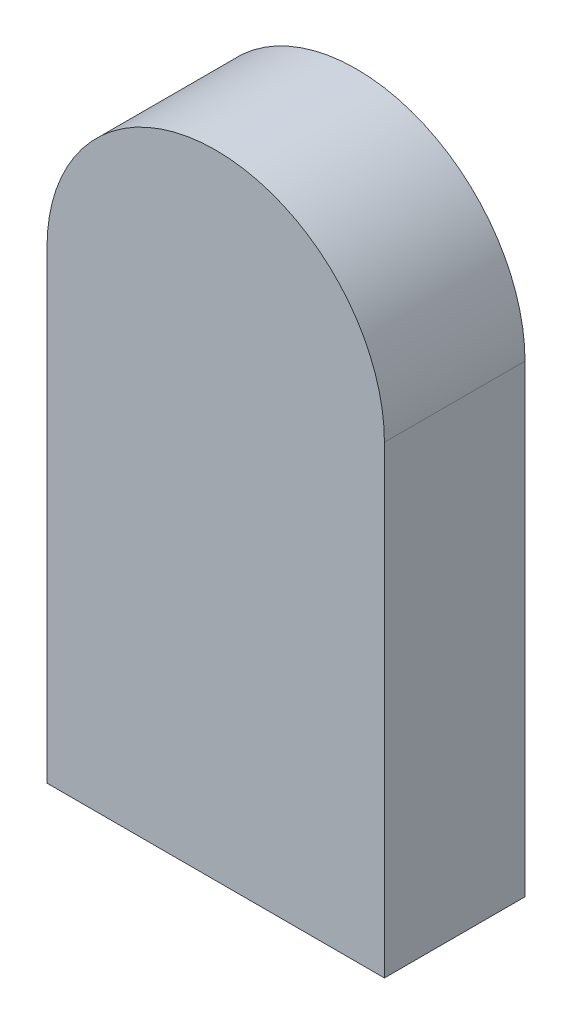
ISO-10303-21;
HEADER;
FILE_DESCRIPTION(('STEP AP214'),'2;1');
FILE_NAME('part.step','',(''),(''),'','','');
FILE_SCHEMA(('AUTOMOTIVE_DESIGN { 1 0 10303 214 1 1 1 1 }'));
ENDSEC;
DATA;
#1=APPLICATION_CONTEXT('core data for automotive mechanical design processes');
#2=APPLICATION_PROTOCOL_DEFINITION('international standard','automotive_design',2000,#1);
#3=PRODUCT_CONTEXT('',#1,'mechanical');
#4=PRODUCT('Part','Part','',(#3));
#5=PRODUCT_RELATED_PRODUCT_CATEGORY('part','',(#4));
#6=PRODUCT_DEFINITION_FORMATION('','',#4);
#7=PRODUCT_DEFINITION_CONTEXT('part definition',#1,'design');
#8=PRODUCT_DEFINITION('design','',#6,#7);
#9=PRODUCT_DEFINITION_SHAPE('','',#8);
#10=(LENGTH_UNIT() NAMED_UNIT(*) SI_UNIT(.MILLI.,.METRE.));
#11=(NAMED_UNIT(*) PLANE_ANGLE_UNIT() SI_UNIT($,.RADIAN.));
#12=(NAMED_UNIT(*) SI_UNIT($,.STERADIAN.) SOLID_ANGLE_UNIT());
#13=UNCERTAINTY_MEASURE_WITH_UNIT(LENGTH_MEASURE(1.E-05),#10,'distance_accuracy_value','');
#14=(GEOMETRIC_REPRESENTATION_CONTEXT(3) GLOBAL_UNCERTAINTY_ASSIGNED_CONTEXT((#13)) GLOBAL_UNIT_ASSIGNED_CONTEXT((#10,
#11,#12)) REPRESENTATION_CONTEXT('',''));
#15=CARTESIAN_POINT('',(0.,0.,0.));
#16=DIRECTION('',(0.,0.,1.));
#17=DIRECTION('',(1.,0.,0.));
#18=AXIS2_PLACEMENT_3D('',#15,#16,#17);
#19=CARTESIAN_POINT('',(-1.37,-4.05,0.));
#20=DIRECTION('',(0.,1.,0.));
#21=DIRECTION('',(1.,0.,0.));
#22=AXIS2_PLACEMENT_3D('',#19,#20,#21);
#23=PLANE('',#22);
#24=DIRECTION('',(1.,0.,0.));
#25=VECTOR('',#24,1.);
#26=CARTESIAN_POINT('',(-1.37,-4.05,0.));
#27=LINE('',#26,#25);
#28=CARTESIAN_POINT('',(-1.37,-4.05,0.));
#29=VERTEX_POINT('',#28);
#30=CARTESIAN_POINT('',(-1.13,-4.05,0.));
#31=VERTEX_POINT('',#30);
#32=EDGE_CURVE('E11',#29,#31,#27,.T.);
#33=ORIENTED_EDGE('',*,*,#32,.T.);
#34=DIRECTION('',(0.,0.,1.));
#35=VECTOR('',#34,1.);
#36=CARTESIAN_POINT('',(-1.13,-4.05,0.));
#37=LINE('',#36,#35);
#38=CARTESIAN_POINT('',(-1.13,-4.05,0.1));
#39=VERTEX_POINT('',#38);
#40=EDGE_CURVE('E24',#31,#39,#37,.T.);
#41=ORIENTED_EDGE('',*,*,#40,.T.);
#42=DIRECTION('',(1.,0.,0.));
#43=VECTOR('',#42,1.);
#44=CARTESIAN_POINT('',(-1.37,-4.05,0.1));
#45=LINE('',#44,#43);
#46=CARTESIAN_POINT('',(-1.37,-4.05,0.1));
#47=VERTEX_POINT('',#46);
#48=EDGE_CURVE('E87',#47,#39,#45,.T.);
#49=ORIENTED_EDGE('',*,*,#48,.F.);
#50=DIRECTION('',(0.,0.,1.));
#51=VECTOR('',#50,1.);
#52=CARTESIAN_POINT('',(-1.37,-4.05,0.));
#53=LINE('',#52,#51);
#54=EDGE_CURVE('E36',#29,#47,#53,.T.);
#55=ORIENTED_EDGE('',*,*,#54,.F.);
#56=EDGE_LOOP('',(#33,#41,#49,#55));
#57=FACE_BOUND('',#56,.T.);
#58=ADVANCED_FACE('F17',(#57),#23,.F.);
#59=CARTESIAN_POINT('',(-1.13,-4.05,0.));
#60=DIRECTION('',(-1.,0.,0.));
#61=DIRECTION('',(0.,1.,0.));
#62=AXIS2_PLACEMENT_3D('',#59,#60,#61);
#63=PLANE('',#62);
#64=DIRECTION('',(0.,1.,0.));
#65=VECTOR('',#64,1.);
#66=CARTESIAN_POINT('',(-1.13,-4.05,0.));
#67=LINE('',#66,#65);
#68=CARTESIAN_POINT('',(-1.13,-3.72,0.));
#69=VERTEX_POINT('',#68);
#70=EDGE_CURVE('E84',#31,#69,#67,.T.);
#71=ORIENTED_EDGE('',*,*,#70,.T.);
#72=DIRECTION('',(0.,0.,1.));
#73=VECTOR('',#72,1.);
#74=CARTESIAN_POINT('',(-1.13,-3.72,0.));
#75=LINE('',#74,#73);
#76=CARTESIAN_POINT('',(-1.13,-3.72,0.1));
#77=VERTEX_POINT('',#76);
#78=EDGE_CURVE('E82',#69,#77,#75,.T.);
#79=ORIENTED_EDGE('',*,*,#78,.T.);
#80=DIRECTION('',(0.,1.,0.));
#81=VECTOR('',#80,1.);
#82=CARTESIAN_POINT('',(-1.13,-4.05,0.1));
#83=LINE('',#82,#81);
#84=EDGE_CURVE('E72',#39,#77,#83,.T.);
#85=ORIENTED_EDGE('',*,*,#84,.F.);
#86=ORIENTED_EDGE('',*,*,#40,.F.);
#87=EDGE_LOOP('',(#71,#79,#85,#86));
#88=FACE_BOUND('',#87,.T.);
#89=ADVANCED_FACE('F89',(#88),#63,.F.);
#90=CARTESIAN_POINT('',(-1.25,-3.72,0.));
#91=DIRECTION('',(0.,0.,-1.));
#92=DIRECTION('',(1.,0.,0.));
#93=AXIS2_PLACEMENT_3D('',#90,#91,#92);
#94=CYLINDRICAL_SURFACE('',#93,0.12);
#95=CARTESIAN_POINT('',(-1.25,-3.72,0.));
#96=DIRECTION('',(0.,0.,1.));
#97=DIRECTION('',(1.,0.,0.));
#98=AXIS2_PLACEMENT_3D('',#95,#96,#97);
#99=CIRCLE('',#98,0.12);
#100=CARTESIAN_POINT('',(-1.37,-3.72,0.));
#101=VERTEX_POINT('',#100);
#102=EDGE_CURVE('E62',#69,#101,#99,.T.);
#103=ORIENTED_EDGE('',*,*,#102,.T.);
#104=DIRECTION('',(0.,0.,1.));
#105=VECTOR('',#104,1.);
#106=CARTESIAN_POINT('',(-1.37,-3.72,0.));
#107=LINE('',#106,#105);
#108=CARTESIAN_POINT('',(-1.37,-3.72,0.1));
#109=VERTEX_POINT('',#108);
#110=EDGE_CURVE('E57',#101,#109,#107,.T.);
#111=ORIENTED_EDGE('',*,*,#110,.T.);
#112=CARTESIAN_POINT('',(-1.25,-3.72,0.1));
#113=DIRECTION('',(0.,0.,1.));
#114=DIRECTION('',(1.,0.,0.));
#115=AXIS2_PLACEMENT_3D('',#112,#113,#114);
#116=CIRCLE('',#115,0.12);
#117=EDGE_CURVE('E60',#77,#109,#116,.T.);
#118=ORIENTED_EDGE('',*,*,#117,.F.);
#119=ORIENTED_EDGE('',*,*,#78,.F.);
#120=EDGE_LOOP('',(#103,#111,#118,#119));
#121=FACE_BOUND('',#120,.T.);
#122=ADVANCED_FACE('F59',(#121),#94,.T.);
#123=CARTESIAN_POINT('',(-1.37,-4.05,0.));
#124=DIRECTION('',(-1.,0.,0.));
#125=DIRECTION('',(0.,1.,0.));
#126=AXIS2_PLACEMENT_3D('',#123,#124,#125);
#127=PLANE('',#126);
#128=ORIENTED_EDGE('',*,*,#54,.T.);
#129=DIRECTION('',(0.,1.,0.));
#130=VECTOR('',#129,1.);
#131=CARTESIAN_POINT('',(-1.37,-4.05,0.1));
#132=LINE('',#131,#130);
#133=EDGE_CURVE('E71',#47,#109,#132,.T.);
#134=ORIENTED_EDGE('',*,*,#133,.T.);
#135=ORIENTED_EDGE('',*,*,#110,.F.);
#136=DIRECTION('',(0.,1.,0.));
#137=VECTOR('',#136,1.);
#138=CARTESIAN_POINT('',(-1.37,-4.05,0.));
#139=LINE('',#138,#137);
#140=EDGE_CURVE('E76',#29,#101,#139,.T.);
#141=ORIENTED_EDGE('',*,*,#140,.F.);
#142=EDGE_LOOP('',(#128,#134,#135,#141));
#143=FACE_BOUND('',#142,.T.);
#144=ADVANCED_FACE('F75',(#143),#127,.T.);
#145=CARTESIAN_POINT('',(-1.25,-3.849490847913,0.));
#146=DIRECTION('',(0.,0.,1.));
#147=DIRECTION('',(1.,0.,0.));
#148=AXIS2_PLACEMENT_3D('',#145,#146,#147);
#149=PLANE('',#148);
#150=ORIENTED_EDGE('',*,*,#140,.T.);
#151=ORIENTED_EDGE('',*,*,#102,.F.);
#152=ORIENTED_EDGE('',*,*,#70,.F.);
#153=ORIENTED_EDGE('',*,*,#32,.F.);
#154=EDGE_LOOP('',(#150,#151,#152,#153));
#155=FACE_BOUND('',#154,.T.);
#156=ADVANCED_FACE('F91',(#155),#149,.F.);
#157=CARTESIAN_POINT('',(-1.25,-3.849490847913,0.1));
#158=DIRECTION('',(0.,0.,1.));
#159=DIRECTION('',(1.,0.,0.));
#160=AXIS2_PLACEMENT_3D('',#157,#158,#159);
#161=PLANE('',#160);
#162=ORIENTED_EDGE('',*,*,#48,.T.);
#163=ORIENTED_EDGE('',*,*,#84,.T.);
#164=ORIENTED_EDGE('',*,*,#117,.T.);
#165=ORIENTED_EDGE('',*,*,#133,.F.);
#166=EDGE_LOOP('',(#162,#163,#164,#165));
#167=FACE_BOUND('',#166,.T.);
#168=ADVANCED_FACE('F70',(#167),#161,.T.);
#169=CLOSED_SHELL('',(#58,#89,#122,#144,#156,#168));
#170=MANIFOLD_SOLID_BREP('B1',#169);
#171=ADVANCED_BREP_SHAPE_REPRESENTATION('',(#18,#170),#14);
#172=SHAPE_DEFINITION_REPRESENTATION(#9,#171);
ENDSEC;
END-ISO-10303-21;
